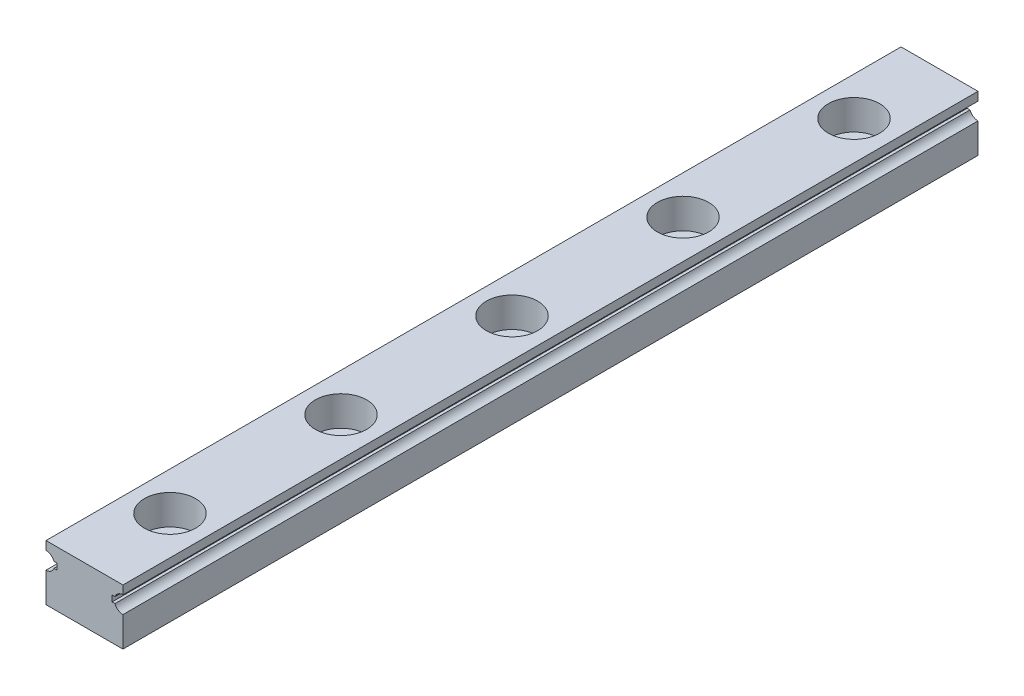
ISO-10303-21;
HEADER;
FILE_DESCRIPTION(('STEP AP214'),'2;1');
FILE_NAME('part.step','',(''),(''),'','','');
FILE_SCHEMA(('AUTOMOTIVE_DESIGN { 1 0 10303 214 1 1 1 1 }'));
ENDSEC;
DATA;
#1=APPLICATION_CONTEXT('core data for automotive mechanical design processes');
#2=APPLICATION_PROTOCOL_DEFINITION('international standard','automotive_design',2000,#1);
#3=PRODUCT_CONTEXT('',#1,'mechanical');
#4=PRODUCT('Part','Part','',(#3));
#5=PRODUCT_RELATED_PRODUCT_CATEGORY('part','',(#4));
#6=PRODUCT_DEFINITION_FORMATION('','',#4);
#7=PRODUCT_DEFINITION_CONTEXT('part definition',#1,'design');
#8=PRODUCT_DEFINITION('design','',#6,#7);
#9=PRODUCT_DEFINITION_SHAPE('','',#8);
#10=(LENGTH_UNIT() NAMED_UNIT(*) SI_UNIT(.MILLI.,.METRE.));
#11=(NAMED_UNIT(*) PLANE_ANGLE_UNIT() SI_UNIT($,.RADIAN.));
#12=(NAMED_UNIT(*) SI_UNIT($,.STERADIAN.) SOLID_ANGLE_UNIT());
#13=UNCERTAINTY_MEASURE_WITH_UNIT(LENGTH_MEASURE(1.E-05),#10,'distance_accuracy_value','');
#14=(GEOMETRIC_REPRESENTATION_CONTEXT(3) GLOBAL_UNCERTAINTY_ASSIGNED_CONTEXT((#13)) GLOBAL_UNIT_ASSIGNED_CONTEXT((#10,
#11,#12)) REPRESENTATION_CONTEXT('',''));
#15=CARTESIAN_POINT('',(0.,0.,0.));
#16=DIRECTION('',(0.,0.,1.));
#17=DIRECTION('',(1.,0.,0.));
#18=AXIS2_PLACEMENT_3D('',#15,#16,#17);
#19=CARTESIAN_POINT('',(4.5,2.25,100.));
#20=DIRECTION('',(-1.,0.,0.));
#21=DIRECTION('',(0.,-1.,0.));
#22=AXIS2_PLACEMENT_3D('',#19,#20,#21);
#23=PLANE('',#22);
#24=DIRECTION('',(0.,1.,0.));
#25=VECTOR('',#24,1.);
#26=CARTESIAN_POINT('',(4.5,2.25,0.));
#27=LINE('',#26,#25);
#28=CARTESIAN_POINT('',(4.5,2.25,0.));
#29=VERTEX_POINT('',#28);
#30=CARTESIAN_POINT('',(4.5,3.25,0.));
#31=VERTEX_POINT('',#30);
#32=EDGE_CURVE('E193',#29,#31,#27,.T.);
#33=ORIENTED_EDGE('',*,*,#32,.T.);
#34=DIRECTION('',(0.,0.,-1.));
#35=VECTOR('',#34,1.);
#36=CARTESIAN_POINT('',(4.5,3.25,100.));
#37=LINE('',#36,#35);
#38=CARTESIAN_POINT('',(4.5,3.25,100.));
#39=VERTEX_POINT('',#38);
#40=EDGE_CURVE('E11',#39,#31,#37,.T.);
#41=ORIENTED_EDGE('',*,*,#40,.F.);
#42=DIRECTION('',(0.,1.,0.));
#43=VECTOR('',#42,1.);
#44=CARTESIAN_POINT('',(4.5,2.25,100.));
#45=LINE('',#44,#43);
#46=CARTESIAN_POINT('',(4.5,2.25,100.));
#47=VERTEX_POINT('',#46);
#48=EDGE_CURVE('E228',#47,#39,#45,.T.);
#49=ORIENTED_EDGE('',*,*,#48,.F.);
#50=DIRECTION('',(0.,0.,-1.));
#51=VECTOR('',#50,1.);
#52=CARTESIAN_POINT('',(4.5,2.25,100.));
#53=LINE('',#52,#51);
#54=EDGE_CURVE('E189',#47,#29,#53,.T.);
#55=ORIENTED_EDGE('',*,*,#54,.T.);
#56=EDGE_LOOP('',(#33,#41,#49,#55));
#57=FACE_BOUND('',#56,.T.);
#58=ADVANCED_FACE('F45',(#57),#23,.F.);
#59=CARTESIAN_POINT('',(-4.5,3.25,100.));
#60=DIRECTION('',(0.,-1.,0.));
#61=DIRECTION('',(0.,0.,-1.));
#62=AXIS2_PLACEMENT_3D('',#59,#60,#61);
#63=PLANE('',#62);
#64=CARTESIAN_POINT('',(0.,3.25,90.));
#65=DIRECTION('',(0.,1.,0.));
#66=DIRECTION('',(0.,0.,1.));
#67=AXIS2_PLACEMENT_3D('',#64,#65,#66);
#68=CIRCLE('',#67,3.);
#69=CARTESIAN_POINT('',(0.,3.25,93.));
#70=VERTEX_POINT('',#69);
#71=EDGE_CURVE('E287',#70,#70,#68,.T.);
#72=ORIENTED_EDGE('',*,*,#71,.F.);
#73=EDGE_LOOP('',(#72));
#74=FACE_BOUND('',#73,.T.);
#75=CARTESIAN_POINT('',(0.,3.25,70.));
#76=DIRECTION('',(0.,1.,0.));
#77=DIRECTION('',(0.,0.,1.));
#78=AXIS2_PLACEMENT_3D('',#75,#76,#77);
#79=CIRCLE('',#78,3.);
#80=CARTESIAN_POINT('',(0.,3.25,73.));
#81=VERTEX_POINT('',#80);
#82=EDGE_CURVE('E320',#81,#81,#79,.T.);
#83=ORIENTED_EDGE('',*,*,#82,.F.);
#84=EDGE_LOOP('',(#83));
#85=FACE_BOUND('',#84,.T.);
#86=CARTESIAN_POINT('',(0.,3.25,50.));
#87=DIRECTION('',(0.,1.,0.));
#88=DIRECTION('',(0.,0.,1.));
#89=AXIS2_PLACEMENT_3D('',#86,#87,#88);
#90=CIRCLE('',#89,3.);
#91=CARTESIAN_POINT('',(0.,3.25,53.));
#92=VERTEX_POINT('',#91);
#93=EDGE_CURVE('E327',#92,#92,#90,.T.);
#94=ORIENTED_EDGE('',*,*,#93,.F.);
#95=EDGE_LOOP('',(#94));
#96=FACE_BOUND('',#95,.T.);
#97=CARTESIAN_POINT('',(0.,3.25,30.));
#98=DIRECTION('',(0.,1.,0.));
#99=DIRECTION('',(0.,0.,1.));
#100=AXIS2_PLACEMENT_3D('',#97,#98,#99);
#101=CIRCLE('',#100,3.);
#102=CARTESIAN_POINT('',(0.,3.25,33.));
#103=VERTEX_POINT('',#102);
#104=EDGE_CURVE('E335',#103,#103,#101,.T.);
#105=ORIENTED_EDGE('',*,*,#104,.F.);
#106=EDGE_LOOP('',(#105));
#107=FACE_BOUND('',#106,.T.);
#108=CARTESIAN_POINT('',(0.,3.25,10.));
#109=DIRECTION('',(0.,1.,0.));
#110=DIRECTION('',(0.,0.,1.));
#111=AXIS2_PLACEMENT_3D('',#108,#109,#110);
#112=CIRCLE('',#111,3.);
#113=CARTESIAN_POINT('',(0.,3.25,13.));
#114=VERTEX_POINT('',#113);
#115=EDGE_CURVE('E282',#114,#114,#112,.T.);
#116=ORIENTED_EDGE('',*,*,#115,.F.);
#117=EDGE_LOOP('',(#116));
#118=FACE_BOUND('',#117,.T.);
#119=DIRECTION('',(-1.,0.,0.));
#120=VECTOR('',#119,1.);
#121=CARTESIAN_POINT('',(-4.5,3.25,0.));
#122=LINE('',#121,#120);
#123=CARTESIAN_POINT('',(-4.5,3.25,0.));
#124=VERTEX_POINT('',#123);
#125=EDGE_CURVE('E196',#31,#124,#122,.T.);
#126=ORIENTED_EDGE('',*,*,#125,.T.);
#127=DIRECTION('',(0.,0.,-1.));
#128=VECTOR('',#127,1.);
#129=CARTESIAN_POINT('',(-4.5,3.25,100.));
#130=LINE('',#129,#128);
#131=CARTESIAN_POINT('',(-4.5,3.25,100.));
#132=VERTEX_POINT('',#131);
#133=EDGE_CURVE('E55',#132,#124,#130,.T.);
#134=ORIENTED_EDGE('',*,*,#133,.F.);
#135=DIRECTION('',(-1.,0.,0.));
#136=VECTOR('',#135,1.);
#137=CARTESIAN_POINT('',(-4.5,3.25,100.));
#138=LINE('',#137,#136);
#139=EDGE_CURVE('E131',#39,#132,#138,.T.);
#140=ORIENTED_EDGE('',*,*,#139,.F.);
#141=ORIENTED_EDGE('',*,*,#40,.T.);
#142=EDGE_LOOP('',(#126,#134,#140,#141));
#143=FACE_BOUND('',#142,.T.);
#144=ADVANCED_FACE('F405',(#74,#85,#96,#107,#118,#143),#63,.F.);
#145=CARTESIAN_POINT('',(-4.5,2.25,100.));
#146=DIRECTION('',(1.,0.,0.));
#147=DIRECTION('',(0.,0.,-1.));
#148=AXIS2_PLACEMENT_3D('',#145,#146,#147);
#149=PLANE('',#148);
#150=DIRECTION('',(0.,-1.,0.));
#151=VECTOR('',#150,1.);
#152=CARTESIAN_POINT('',(-4.5,2.25,0.));
#153=LINE('',#152,#151);
#154=CARTESIAN_POINT('',(-4.5,2.25,0.));
#155=VERTEX_POINT('',#154);
#156=EDGE_CURVE('E200',#124,#155,#153,.T.);
#157=ORIENTED_EDGE('',*,*,#156,.T.);
#158=DIRECTION('',(0.,0.,-1.));
#159=VECTOR('',#158,1.);
#160=CARTESIAN_POINT('',(-4.5,2.25,100.));
#161=LINE('',#160,#159);
#162=CARTESIAN_POINT('',(-4.5,2.25,100.));
#163=VERTEX_POINT('',#162);
#164=EDGE_CURVE('E271',#163,#155,#161,.T.);
#165=ORIENTED_EDGE('',*,*,#164,.F.);
#166=DIRECTION('',(0.,-1.,0.));
#167=VECTOR('',#166,1.);
#168=CARTESIAN_POINT('',(-4.5,2.25,100.));
#169=LINE('',#168,#167);
#170=EDGE_CURVE('E357',#132,#163,#169,.T.);
#171=ORIENTED_EDGE('',*,*,#170,.F.);
#172=ORIENTED_EDGE('',*,*,#133,.T.);
#173=EDGE_LOOP('',(#157,#165,#171,#172));
#174=FACE_BOUND('',#173,.T.);
#175=ADVANCED_FACE('F410',(#174),#149,.F.);
#176=CARTESIAN_POINT('',(-4.5,1.25,100.));
#177=DIRECTION('',(0.,0.,-1.));
#178=DIRECTION('',(-1.,0.,0.));
#179=AXIS2_PLACEMENT_3D('',#176,#177,#178);
#180=CYLINDRICAL_SURFACE('',#179,1.);
#181=CARTESIAN_POINT('',(-4.5,1.25,0.));
#182=DIRECTION('',(0.,0.,-1.));
#183=DIRECTION('',(1.,0.,0.));
#184=AXIS2_PLACEMENT_3D('',#181,#182,#183);
#185=CIRCLE('',#184,1.);
#186=CARTESIAN_POINT('',(-3.56399113733362,1.60197643246385,0.));
#187=VERTEX_POINT('',#186);
#188=EDGE_CURVE('E202',#155,#187,#185,.T.);
#189=ORIENTED_EDGE('',*,*,#188,.T.);
#190=DIRECTION('',(0.,0.,-1.));
#191=VECTOR('',#190,1.);
#192=CARTESIAN_POINT('',(-3.56399113733362,1.60197643246385,100.));
#193=LINE('',#192,#191);
#194=CARTESIAN_POINT('',(-3.56399113733362,1.60197643246385,100.));
#195=VERTEX_POINT('',#194);
#196=EDGE_CURVE('E267',#195,#187,#193,.T.);
#197=ORIENTED_EDGE('',*,*,#196,.F.);
#198=CARTESIAN_POINT('',(-4.5,1.25,100.));
#199=DIRECTION('',(0.,0.,-1.));
#200=DIRECTION('',(1.,0.,0.));
#201=AXIS2_PLACEMENT_3D('',#198,#199,#200);
#202=CIRCLE('',#201,1.);
#203=EDGE_CURVE('E359',#163,#195,#202,.T.);
#204=ORIENTED_EDGE('',*,*,#203,.F.);
#205=ORIENTED_EDGE('',*,*,#164,.T.);
#206=EDGE_LOOP('',(#189,#197,#204,#205));
#207=FACE_BOUND('',#206,.T.);
#208=ADVANCED_FACE('F415',(#207),#180,.F.);
#209=CARTESIAN_POINT('',(-3.56399113733362,1.60197643246385,100.));
#210=DIRECTION('',(0.,1.,0.));
#211=DIRECTION('',(0.,0.,1.));
#212=AXIS2_PLACEMENT_3D('',#209,#210,#211);
#213=PLANE('',#212);
#214=DIRECTION('',(1.,0.,0.));
#215=VECTOR('',#214,1.);
#216=CARTESIAN_POINT('',(-3.56399113733362,1.60197643246385,0.));
#217=LINE('',#216,#215);
#218=CARTESIAN_POINT('',(-3.23507302495561,1.60197643246385,0.));
#219=VERTEX_POINT('',#218);
#220=EDGE_CURVE('E204',#187,#219,#217,.T.);
#221=ORIENTED_EDGE('',*,*,#220,.T.);
#222=DIRECTION('',(0.,0.,-1.));
#223=VECTOR('',#222,1.);
#224=CARTESIAN_POINT('',(-3.23507302495561,1.60197643246385,100.));
#225=LINE('',#224,#223);
#226=CARTESIAN_POINT('',(-3.23507302495561,1.60197643246385,100.));
#227=VERTEX_POINT('',#226);
#228=EDGE_CURVE('E263',#227,#219,#225,.T.);
#229=ORIENTED_EDGE('',*,*,#228,.F.);
#230=DIRECTION('',(1.,0.,0.));
#231=VECTOR('',#230,1.);
#232=CARTESIAN_POINT('',(-3.56399113733362,1.60197643246385,100.));
#233=LINE('',#232,#231);
#234=EDGE_CURVE('E361',#195,#227,#233,.T.);
#235=ORIENTED_EDGE('',*,*,#234,.F.);
#236=ORIENTED_EDGE('',*,*,#196,.T.);
#237=EDGE_LOOP('',(#221,#229,#235,#236));
#238=FACE_BOUND('',#237,.T.);
#239=ADVANCED_FACE('F423',(#238),#213,.F.);
#240=CARTESIAN_POINT('',(-3.23507302495561,0.898023567536146,100.));
#241=DIRECTION('',(1.,0.,0.));
#242=DIRECTION('',(0.,0.,-1.));
#243=AXIS2_PLACEMENT_3D('',#240,#241,#242);
#244=PLANE('',#243);
#245=DIRECTION('',(0.,-1.,0.));
#246=VECTOR('',#245,1.);
#247=CARTESIAN_POINT('',(-3.23507302495561,0.898023567536146,0.));
#248=LINE('',#247,#246);
#249=CARTESIAN_POINT('',(-3.23507302495561,0.898023567536146,0.));
#250=VERTEX_POINT('',#249);
#251=EDGE_CURVE('E206',#219,#250,#248,.T.);
#252=ORIENTED_EDGE('',*,*,#251,.T.);
#253=DIRECTION('',(0.,0.,-1.));
#254=VECTOR('',#253,1.);
#255=CARTESIAN_POINT('',(-3.23507302495561,0.898023567536146,100.));
#256=LINE('',#255,#254);
#257=CARTESIAN_POINT('',(-3.23507302495561,0.898023567536146,100.));
#258=VERTEX_POINT('',#257);
#259=EDGE_CURVE('E259',#258,#250,#256,.T.);
#260=ORIENTED_EDGE('',*,*,#259,.F.);
#261=DIRECTION('',(0.,-1.,0.));
#262=VECTOR('',#261,1.);
#263=CARTESIAN_POINT('',(-3.23507302495561,0.898023567536146,100.));
#264=LINE('',#263,#262);
#265=EDGE_CURVE('E363',#227,#258,#264,.T.);
#266=ORIENTED_EDGE('',*,*,#265,.F.);
#267=ORIENTED_EDGE('',*,*,#228,.T.);
#268=EDGE_LOOP('',(#252,#260,#266,#267));
#269=FACE_BOUND('',#268,.T.);
#270=ADVANCED_FACE('F427',(#269),#244,.F.);
#271=CARTESIAN_POINT('',(-3.56399113733362,0.898023567536146,100.));
#272=DIRECTION('',(0.,-1.,0.));
#273=DIRECTION('',(0.,0.,-1.));
#274=AXIS2_PLACEMENT_3D('',#271,#272,#273);
#275=PLANE('',#274);
#276=DIRECTION('',(-1.,0.,0.));
#277=VECTOR('',#276,1.);
#278=CARTESIAN_POINT('',(-3.56399113733362,0.898023567536146,0.));
#279=LINE('',#278,#277);
#280=CARTESIAN_POINT('',(-3.56399113733362,0.898023567536146,0.));
#281=VERTEX_POINT('',#280);
#282=EDGE_CURVE('E208',#250,#281,#279,.T.);
#283=ORIENTED_EDGE('',*,*,#282,.T.);
#284=DIRECTION('',(0.,0.,-1.));
#285=VECTOR('',#284,1.);
#286=CARTESIAN_POINT('',(-3.56399113733362,0.898023567536146,100.));
#287=LINE('',#286,#285);
#288=CARTESIAN_POINT('',(-3.56399113733362,0.898023567536146,100.));
#289=VERTEX_POINT('',#288);
#290=EDGE_CURVE('E255',#289,#281,#287,.T.);
#291=ORIENTED_EDGE('',*,*,#290,.F.);
#292=DIRECTION('',(-1.,0.,0.));
#293=VECTOR('',#292,1.);
#294=CARTESIAN_POINT('',(-3.56399113733362,0.898023567536146,100.));
#295=LINE('',#294,#293);
#296=EDGE_CURVE('E365',#258,#289,#295,.T.);
#297=ORIENTED_EDGE('',*,*,#296,.F.);
#298=ORIENTED_EDGE('',*,*,#259,.T.);
#299=EDGE_LOOP('',(#283,#291,#297,#298));
#300=FACE_BOUND('',#299,.T.);
#301=ADVANCED_FACE('F431',(#300),#275,.F.);
#302=CARTESIAN_POINT('',(-4.5,1.25,100.));
#303=DIRECTION('',(0.,0.,-1.));
#304=DIRECTION('',(-1.,0.,0.));
#305=AXIS2_PLACEMENT_3D('',#302,#303,#304);
#306=CYLINDRICAL_SURFACE('',#305,1.);
#307=CARTESIAN_POINT('',(-4.5,1.25,0.));
#308=DIRECTION('',(0.,0.,-1.));
#309=DIRECTION('',(1.,0.,0.));
#310=AXIS2_PLACEMENT_3D('',#307,#308,#309);
#311=CIRCLE('',#310,1.);
#312=CARTESIAN_POINT('',(-4.5,0.25,0.));
#313=VERTEX_POINT('',#312);
#314=EDGE_CURVE('E210',#281,#313,#311,.T.);
#315=ORIENTED_EDGE('',*,*,#314,.T.);
#316=DIRECTION('',(0.,0.,-1.));
#317=VECTOR('',#316,1.);
#318=CARTESIAN_POINT('',(-4.5,0.25,100.));
#319=LINE('',#318,#317);
#320=CARTESIAN_POINT('',(-4.5,0.25,100.));
#321=VERTEX_POINT('',#320);
#322=EDGE_CURVE('E251',#321,#313,#319,.T.);
#323=ORIENTED_EDGE('',*,*,#322,.F.);
#324=CARTESIAN_POINT('',(-4.5,1.25,100.));
#325=DIRECTION('',(0.,0.,-1.));
#326=DIRECTION('',(1.,0.,0.));
#327=AXIS2_PLACEMENT_3D('',#324,#325,#326);
#328=CIRCLE('',#327,1.);
#329=EDGE_CURVE('E367',#289,#321,#328,.T.);
#330=ORIENTED_EDGE('',*,*,#329,.F.);
#331=ORIENTED_EDGE('',*,*,#290,.T.);
#332=EDGE_LOOP('',(#315,#323,#330,#331));
#333=FACE_BOUND('',#332,.T.);
#334=ADVANCED_FACE('F435',(#333),#306,.F.);
#335=CARTESIAN_POINT('',(-4.5,-3.25,100.));
#336=DIRECTION('',(1.,0.,0.));
#337=DIRECTION('',(0.,0.,-1.));
#338=AXIS2_PLACEMENT_3D('',#335,#336,#337);
#339=PLANE('',#338);
#340=DIRECTION('',(0.,-1.,0.));
#341=VECTOR('',#340,1.);
#342=CARTESIAN_POINT('',(-4.5,-3.25,0.));
#343=LINE('',#342,#341);
#344=CARTESIAN_POINT('',(-4.5,-3.25,0.));
#345=VERTEX_POINT('',#344);
#346=EDGE_CURVE('E212',#313,#345,#343,.T.);
#347=ORIENTED_EDGE('',*,*,#346,.T.);
#348=DIRECTION('',(0.,0.,-1.));
#349=VECTOR('',#348,1.);
#350=CARTESIAN_POINT('',(-4.5,-3.25,100.));
#351=LINE('',#350,#349);
#352=CARTESIAN_POINT('',(-4.5,-3.25,100.));
#353=VERTEX_POINT('',#352);
#354=EDGE_CURVE('E247',#353,#345,#351,.T.);
#355=ORIENTED_EDGE('',*,*,#354,.F.);
#356=DIRECTION('',(0.,-1.,0.));
#357=VECTOR('',#356,1.);
#358=CARTESIAN_POINT('',(-4.5,-3.25,100.));
#359=LINE('',#358,#357);
#360=EDGE_CURVE('E369',#321,#353,#359,.T.);
#361=ORIENTED_EDGE('',*,*,#360,.F.);
#362=ORIENTED_EDGE('',*,*,#322,.T.);
#363=EDGE_LOOP('',(#347,#355,#361,#362));
#364=FACE_BOUND('',#363,.T.);
#365=ADVANCED_FACE('F439',(#364),#339,.F.);
#366=CARTESIAN_POINT('',(-4.5,-3.25,100.));
#367=DIRECTION('',(0.,1.,0.));
#368=DIRECTION('',(0.,0.,1.));
#369=AXIS2_PLACEMENT_3D('',#366,#367,#368);
#370=PLANE('',#369);
#371=CARTESIAN_POINT('',(0.,-3.25,90.));
#372=DIRECTION('',(0.,1.,0.));
#373=DIRECTION('',(0.,0.,1.));
#374=AXIS2_PLACEMENT_3D('',#371,#372,#373);
#375=CIRCLE('',#374,1.75);
#376=CARTESIAN_POINT('',(0.,-3.25,91.75));
#377=VERTEX_POINT('',#376);
#378=EDGE_CURVE('E312',#377,#377,#375,.T.);
#379=ORIENTED_EDGE('',*,*,#378,.T.);
#380=EDGE_LOOP('',(#379));
#381=FACE_BOUND('',#380,.T.);
#382=CARTESIAN_POINT('',(0.,-3.25,70.));
#383=DIRECTION('',(0.,1.,0.));
#384=DIRECTION('',(0.,0.,1.));
#385=AXIS2_PLACEMENT_3D('',#382,#383,#384);
#386=CIRCLE('',#385,1.75);
#387=CARTESIAN_POINT('',(0.,-3.25,71.75));
#388=VERTEX_POINT('',#387);
#389=EDGE_CURVE('E296',#388,#388,#386,.T.);
#390=ORIENTED_EDGE('',*,*,#389,.T.);
#391=EDGE_LOOP('',(#390));
#392=FACE_BOUND('',#391,.T.);
#393=CARTESIAN_POINT('',(0.,-3.25,50.));
#394=DIRECTION('',(0.,1.,0.));
#395=DIRECTION('',(0.,0.,1.));
#396=AXIS2_PLACEMENT_3D('',#393,#394,#395);
#397=CIRCLE('',#396,1.75);
#398=CARTESIAN_POINT('',(0.,-3.25,51.75));
#399=VERTEX_POINT('',#398);
#400=EDGE_CURVE('E292',#399,#399,#397,.T.);
#401=ORIENTED_EDGE('',*,*,#400,.T.);
#402=EDGE_LOOP('',(#401));
#403=FACE_BOUND('',#402,.T.);
#404=CARTESIAN_POINT('',(0.,-3.25,30.));
#405=DIRECTION('',(0.,1.,0.));
#406=DIRECTION('',(0.,0.,1.));
#407=AXIS2_PLACEMENT_3D('',#404,#405,#406);
#408=CIRCLE('',#407,1.75);
#409=CARTESIAN_POINT('',(0.,-3.25,31.75));
#410=VERTEX_POINT('',#409);
#411=EDGE_CURVE('E288',#410,#410,#408,.T.);
#412=ORIENTED_EDGE('',*,*,#411,.T.);
#413=EDGE_LOOP('',(#412));
#414=FACE_BOUND('',#413,.T.);
#415=CARTESIAN_POINT('',(0.,-3.25,10.));
#416=DIRECTION('',(0.,1.,0.));
#417=DIRECTION('',(0.,0.,1.));
#418=AXIS2_PLACEMENT_3D('',#415,#416,#417);
#419=CIRCLE('',#418,1.75);
#420=CARTESIAN_POINT('',(0.,-3.25,11.75));
#421=VERTEX_POINT('',#420);
#422=EDGE_CURVE('E283',#421,#421,#419,.T.);
#423=ORIENTED_EDGE('',*,*,#422,.T.);
#424=EDGE_LOOP('',(#423));
#425=FACE_BOUND('',#424,.T.);
#426=DIRECTION('',(1.,0.,0.));
#427=VECTOR('',#426,1.);
#428=CARTESIAN_POINT('',(-4.5,-3.25,0.));
#429=LINE('',#428,#427);
#430=CARTESIAN_POINT('',(4.5,-3.25,0.));
#431=VERTEX_POINT('',#430);
#432=EDGE_CURVE('E215',#345,#431,#429,.T.);
#433=ORIENTED_EDGE('',*,*,#432,.T.);
#434=DIRECTION('',(0.,0.,-1.));
#435=VECTOR('',#434,1.);
#436=CARTESIAN_POINT('',(4.5,-3.25,100.));
#437=LINE('',#436,#435);
#438=CARTESIAN_POINT('',(4.5,-3.25,100.));
#439=VERTEX_POINT('',#438);
#440=EDGE_CURVE('E243',#439,#431,#437,.T.);
#441=ORIENTED_EDGE('',*,*,#440,.F.);
#442=DIRECTION('',(1.,0.,0.));
#443=VECTOR('',#442,1.);
#444=CARTESIAN_POINT('',(-4.5,-3.25,100.));
#445=LINE('',#444,#443);
#446=EDGE_CURVE('E371',#353,#439,#445,.T.);
#447=ORIENTED_EDGE('',*,*,#446,.F.);
#448=ORIENTED_EDGE('',*,*,#354,.T.);
#449=EDGE_LOOP('',(#433,#441,#447,#448));
#450=FACE_BOUND('',#449,.T.);
#451=ADVANCED_FACE('F443',(#381,#392,#403,#414,#425,#450),#370,.F.);
#452=CARTESIAN_POINT('',(4.5,-3.25,100.));
#453=DIRECTION('',(-1.,0.,0.));
#454=DIRECTION('',(0.,-1.,0.));
#455=AXIS2_PLACEMENT_3D('',#452,#453,#454);
#456=PLANE('',#455);
#457=DIRECTION('',(0.,1.,0.));
#458=VECTOR('',#457,1.);
#459=CARTESIAN_POINT('',(4.5,-3.25,0.));
#460=LINE('',#459,#458);
#461=CARTESIAN_POINT('',(4.5,0.25,0.));
#462=VERTEX_POINT('',#461);
#463=EDGE_CURVE('E218',#431,#462,#460,.T.);
#464=ORIENTED_EDGE('',*,*,#463,.T.);
#465=DIRECTION('',(0.,0.,-1.));
#466=VECTOR('',#465,1.);
#467=CARTESIAN_POINT('',(4.5,0.25,100.));
#468=LINE('',#467,#466);
#469=CARTESIAN_POINT('',(4.5,0.25,100.));
#470=VERTEX_POINT('',#469);
#471=EDGE_CURVE('E239',#470,#462,#468,.T.);
#472=ORIENTED_EDGE('',*,*,#471,.F.);
#473=DIRECTION('',(0.,1.,0.));
#474=VECTOR('',#473,1.);
#475=CARTESIAN_POINT('',(4.5,-3.25,100.));
#476=LINE('',#475,#474);
#477=EDGE_CURVE('E373',#439,#470,#476,.T.);
#478=ORIENTED_EDGE('',*,*,#477,.F.);
#479=ORIENTED_EDGE('',*,*,#440,.T.);
#480=EDGE_LOOP('',(#464,#472,#478,#479));
#481=FACE_BOUND('',#480,.T.);
#482=ADVANCED_FACE('F447',(#481),#456,.F.);
#483=CARTESIAN_POINT('',(4.5,1.25,100.));
#484=DIRECTION('',(0.,0.,-1.));
#485=DIRECTION('',(-1.,0.,0.));
#486=AXIS2_PLACEMENT_3D('',#483,#484,#485);
#487=CYLINDRICAL_SURFACE('',#486,1.);
#488=CARTESIAN_POINT('',(4.5,1.25,0.));
#489=DIRECTION('',(0.,0.,-1.));
#490=DIRECTION('',(-1.,0.,0.));
#491=AXIS2_PLACEMENT_3D('',#488,#489,#490);
#492=CIRCLE('',#491,1.);
#493=CARTESIAN_POINT('',(3.56399113733362,0.898023567536145,0.));
#494=VERTEX_POINT('',#493);
#495=EDGE_CURVE('E221',#462,#494,#492,.T.);
#496=ORIENTED_EDGE('',*,*,#495,.T.);
#497=DIRECTION('',(0.,0.,-1.));
#498=VECTOR('',#497,1.);
#499=CARTESIAN_POINT('',(3.56399113733362,0.898023567536145,100.));
#500=LINE('',#499,#498);
#501=CARTESIAN_POINT('',(3.56399113733362,0.898023567536145,100.));
#502=VERTEX_POINT('',#501);
#503=EDGE_CURVE('E235',#502,#494,#500,.T.);
#504=ORIENTED_EDGE('',*,*,#503,.F.);
#505=CARTESIAN_POINT('',(4.5,1.25,100.));
#506=DIRECTION('',(0.,0.,-1.));
#507=DIRECTION('',(-1.,0.,0.));
#508=AXIS2_PLACEMENT_3D('',#505,#506,#507);
#509=CIRCLE('',#508,1.);
#510=EDGE_CURVE('E375',#470,#502,#509,.T.);
#511=ORIENTED_EDGE('',*,*,#510,.F.);
#512=ORIENTED_EDGE('',*,*,#471,.T.);
#513=EDGE_LOOP('',(#496,#504,#511,#512));
#514=FACE_BOUND('',#513,.T.);
#515=ADVANCED_FACE('F381',(#514),#487,.F.);
#516=CARTESIAN_POINT('',(3.56399113733362,0.898023567536146,100.));
#517=DIRECTION('',(0.,-1.,0.));
#518=DIRECTION('',(0.,0.,-1.));
#519=AXIS2_PLACEMENT_3D('',#516,#517,#518);
#520=PLANE('',#519);
#521=DIRECTION('',(-1.,0.,0.));
#522=VECTOR('',#521,1.);
#523=CARTESIAN_POINT('',(3.56399113733362,0.898023567536146,0.));
#524=LINE('',#523,#522);
#525=CARTESIAN_POINT('',(3.23507302495561,0.898023567536146,0.));
#526=VERTEX_POINT('',#525);
#527=EDGE_CURVE('E223',#494,#526,#524,.T.);
#528=ORIENTED_EDGE('',*,*,#527,.T.);
#529=DIRECTION('',(0.,0.,-1.));
#530=VECTOR('',#529,1.);
#531=CARTESIAN_POINT('',(3.23507302495561,0.898023567536146,100.));
#532=LINE('',#531,#530);
#533=CARTESIAN_POINT('',(3.23507302495561,0.898023567536146,100.));
#534=VERTEX_POINT('',#533);
#535=EDGE_CURVE('E184',#534,#526,#532,.T.);
#536=ORIENTED_EDGE('',*,*,#535,.F.);
#537=DIRECTION('',(-1.,0.,0.));
#538=VECTOR('',#537,1.);
#539=CARTESIAN_POINT('',(3.56399113733362,0.898023567536146,100.));
#540=LINE('',#539,#538);
#541=EDGE_CURVE('E174',#502,#534,#540,.T.);
#542=ORIENTED_EDGE('',*,*,#541,.F.);
#543=ORIENTED_EDGE('',*,*,#503,.T.);
#544=EDGE_LOOP('',(#528,#536,#542,#543));
#545=FACE_BOUND('',#544,.T.);
#546=ADVANCED_FACE('F385',(#545),#520,.F.);
#547=CARTESIAN_POINT('',(3.23507302495561,0.898023567536146,100.));
#548=DIRECTION('',(-1.,0.,0.));
#549=DIRECTION('',(0.,0.,1.));
#550=AXIS2_PLACEMENT_3D('',#547,#548,#549);
#551=PLANE('',#550);
#552=DIRECTION('',(0.,1.,0.));
#553=VECTOR('',#552,1.);
#554=CARTESIAN_POINT('',(3.23507302495561,0.898023567536146,0.));
#555=LINE('',#554,#553);
#556=CARTESIAN_POINT('',(3.23507302495561,1.60197643246385,0.));
#557=VERTEX_POINT('',#556);
#558=EDGE_CURVE('E182',#526,#557,#555,.T.);
#559=ORIENTED_EDGE('',*,*,#558,.T.);
#560=DIRECTION('',(0.,0.,-1.));
#561=VECTOR('',#560,1.);
#562=CARTESIAN_POINT('',(3.23507302495561,1.60197643246385,100.));
#563=LINE('',#562,#561);
#564=CARTESIAN_POINT('',(3.23507302495561,1.60197643246385,100.));
#565=VERTEX_POINT('',#564);
#566=EDGE_CURVE('E179',#565,#557,#563,.T.);
#567=ORIENTED_EDGE('',*,*,#566,.F.);
#568=DIRECTION('',(0.,1.,0.));
#569=VECTOR('',#568,1.);
#570=CARTESIAN_POINT('',(3.23507302495561,0.898023567536146,100.));
#571=LINE('',#570,#569);
#572=EDGE_CURVE('E168',#534,#565,#571,.T.);
#573=ORIENTED_EDGE('',*,*,#572,.F.);
#574=ORIENTED_EDGE('',*,*,#535,.T.);
#575=EDGE_LOOP('',(#559,#567,#573,#574));
#576=FACE_BOUND('',#575,.T.);
#577=ADVANCED_FACE('F180',(#576),#551,.F.);
#578=CARTESIAN_POINT('',(3.56399113733362,1.60197643246385,100.));
#579=DIRECTION('',(0.,1.,0.));
#580=DIRECTION('',(0.,0.,1.));
#581=AXIS2_PLACEMENT_3D('',#578,#579,#580);
#582=PLANE('',#581);
#583=DIRECTION('',(1.,0.,0.));
#584=VECTOR('',#583,1.);
#585=CARTESIAN_POINT('',(3.56399113733362,1.60197643246385,0.));
#586=LINE('',#585,#584);
#587=CARTESIAN_POINT('',(3.56399113733362,1.60197643246385,0.));
#588=VERTEX_POINT('',#587);
#589=EDGE_CURVE('E117',#557,#588,#586,.T.);
#590=ORIENTED_EDGE('',*,*,#589,.T.);
#591=DIRECTION('',(0.,0.,-1.));
#592=VECTOR('',#591,1.);
#593=CARTESIAN_POINT('',(3.56399113733362,1.60197643246385,100.));
#594=LINE('',#593,#592);
#595=CARTESIAN_POINT('',(3.56399113733362,1.60197643246385,100.));
#596=VERTEX_POINT('',#595);
#597=EDGE_CURVE('E185',#596,#588,#594,.T.);
#598=ORIENTED_EDGE('',*,*,#597,.F.);
#599=DIRECTION('',(1.,0.,0.));
#600=VECTOR('',#599,1.);
#601=CARTESIAN_POINT('',(3.56399113733362,1.60197643246385,100.));
#602=LINE('',#601,#600);
#603=EDGE_CURVE('E172',#565,#596,#602,.T.);
#604=ORIENTED_EDGE('',*,*,#603,.F.);
#605=ORIENTED_EDGE('',*,*,#566,.T.);
#606=EDGE_LOOP('',(#590,#598,#604,#605));
#607=FACE_BOUND('',#606,.T.);
#608=ADVANCED_FACE('F187',(#607),#582,.F.);
#609=CARTESIAN_POINT('',(4.5,1.25,100.));
#610=DIRECTION('',(0.,0.,-1.));
#611=DIRECTION('',(-1.,0.,0.));
#612=AXIS2_PLACEMENT_3D('',#609,#610,#611);
#613=CYLINDRICAL_SURFACE('',#612,1.);
#614=CARTESIAN_POINT('',(4.5,1.25,0.));
#615=DIRECTION('',(0.,0.,-1.));
#616=DIRECTION('',(-1.,0.,0.));
#617=AXIS2_PLACEMENT_3D('',#614,#615,#616);
#618=CIRCLE('',#617,1.);
#619=EDGE_CURVE('E123',#588,#29,#618,.T.);
#620=ORIENTED_EDGE('',*,*,#619,.T.);
#621=ORIENTED_EDGE('',*,*,#54,.F.);
#622=CARTESIAN_POINT('',(4.5,1.25,100.));
#623=DIRECTION('',(0.,0.,-1.));
#624=DIRECTION('',(-1.,0.,0.));
#625=AXIS2_PLACEMENT_3D('',#622,#623,#624);
#626=CIRCLE('',#625,1.);
#627=EDGE_CURVE('E64',#596,#47,#626,.T.);
#628=ORIENTED_EDGE('',*,*,#627,.F.);
#629=ORIENTED_EDGE('',*,*,#597,.T.);
#630=EDGE_LOOP('',(#620,#621,#628,#629));
#631=FACE_BOUND('',#630,.T.);
#632=ADVANCED_FACE('F393',(#631),#613,.F.);
#633=CARTESIAN_POINT('',(-4.5,1.25,100.));
#634=DIRECTION('',(0.,0.,1.));
#635=DIRECTION('',(1.,0.,0.));
#636=AXIS2_PLACEMENT_3D('',#633,#634,#635);
#637=PLANE('',#636);
#638=ORIENTED_EDGE('',*,*,#48,.T.);
#639=ORIENTED_EDGE('',*,*,#139,.T.);
#640=ORIENTED_EDGE('',*,*,#170,.T.);
#641=ORIENTED_EDGE('',*,*,#203,.T.);
#642=ORIENTED_EDGE('',*,*,#234,.T.);
#643=ORIENTED_EDGE('',*,*,#265,.T.);
#644=ORIENTED_EDGE('',*,*,#296,.T.);
#645=ORIENTED_EDGE('',*,*,#329,.T.);
#646=ORIENTED_EDGE('',*,*,#360,.T.);
#647=ORIENTED_EDGE('',*,*,#446,.T.);
#648=ORIENTED_EDGE('',*,*,#477,.T.);
#649=ORIENTED_EDGE('',*,*,#510,.T.);
#650=ORIENTED_EDGE('',*,*,#541,.T.);
#651=ORIENTED_EDGE('',*,*,#572,.T.);
#652=ORIENTED_EDGE('',*,*,#603,.T.);
#653=ORIENTED_EDGE('',*,*,#627,.T.);
#654=EDGE_LOOP('',(#638,#639,#640,#641,#642,#643,#644,#645,#646,#647,#648,#649,#650,#651,#652,#653));
#655=FACE_BOUND('',#654,.T.);
#656=ADVANCED_FACE('F170',(#655),#637,.T.);
#657=CARTESIAN_POINT('',(-4.5,1.25,0.));
#658=DIRECTION('',(0.,0.,1.));
#659=DIRECTION('',(1.,0.,0.));
#660=AXIS2_PLACEMENT_3D('',#657,#658,#659);
#661=PLANE('',#660);
#662=ORIENTED_EDGE('',*,*,#32,.F.);
#663=ORIENTED_EDGE('',*,*,#619,.F.);
#664=ORIENTED_EDGE('',*,*,#589,.F.);
#665=ORIENTED_EDGE('',*,*,#558,.F.);
#666=ORIENTED_EDGE('',*,*,#527,.F.);
#667=ORIENTED_EDGE('',*,*,#495,.F.);
#668=ORIENTED_EDGE('',*,*,#463,.F.);
#669=ORIENTED_EDGE('',*,*,#432,.F.);
#670=ORIENTED_EDGE('',*,*,#346,.F.);
#671=ORIENTED_EDGE('',*,*,#314,.F.);
#672=ORIENTED_EDGE('',*,*,#282,.F.);
#673=ORIENTED_EDGE('',*,*,#251,.F.);
#674=ORIENTED_EDGE('',*,*,#220,.F.);
#675=ORIENTED_EDGE('',*,*,#188,.F.);
#676=ORIENTED_EDGE('',*,*,#156,.F.);
#677=ORIENTED_EDGE('',*,*,#125,.F.);
#678=EDGE_LOOP('',(#662,#663,#664,#665,#666,#667,#668,#669,#670,#671,#672,#673,#674,#675,#676,#677));
#679=FACE_BOUND('',#678,.T.);
#680=ADVANCED_FACE('F388',(#679),#661,.F.);
#681=CARTESIAN_POINT('',(0.,-0.25,10.));
#682=DIRECTION('',(0.,1.,0.));
#683=DIRECTION('',(0.,0.,1.));
#684=AXIS2_PLACEMENT_3D('',#681,#682,#683);
#685=CYLINDRICAL_SURFACE('',#684,3.);
#686=CARTESIAN_POINT('',(0.,-0.25,10.));
#687=DIRECTION('',(0.,1.,0.));
#688=DIRECTION('',(0.,0.,1.));
#689=AXIS2_PLACEMENT_3D('',#686,#687,#688);
#690=CIRCLE('',#689,3.);
#691=CARTESIAN_POINT('',(0.,-0.25,13.));
#692=VERTEX_POINT('',#691);
#693=EDGE_CURVE('E197',#692,#692,#690,.T.);
#694=ORIENTED_EDGE('',*,*,#693,.F.);
#695=EDGE_LOOP('',(#694));
#696=FACE_BOUND('',#695,.T.);
#697=ORIENTED_EDGE('',*,*,#115,.T.);
#698=EDGE_LOOP('',(#697));
#699=FACE_BOUND('',#698,.T.);
#700=ADVANCED_FACE('F486',(#696,#699),#685,.F.);
#701=CARTESIAN_POINT('',(0.,-0.25,10.));
#702=DIRECTION('',(0.,1.,0.));
#703=DIRECTION('',(0.,0.,1.));
#704=AXIS2_PLACEMENT_3D('',#701,#702,#703);
#705=PLANE('',#704);
#706=CARTESIAN_POINT('',(0.,-0.25,10.));
#707=DIRECTION('',(0.,1.,0.));
#708=DIRECTION('',(0.,0.,1.));
#709=AXIS2_PLACEMENT_3D('',#706,#707,#708);
#710=CIRCLE('',#709,1.75);
#711=CARTESIAN_POINT('',(0.,-0.25,11.75));
#712=VERTEX_POINT('',#711);
#713=EDGE_CURVE('E278',#712,#712,#710,.T.);
#714=ORIENTED_EDGE('',*,*,#713,.F.);
#715=EDGE_LOOP('',(#714));
#716=FACE_BOUND('',#715,.T.);
#717=ORIENTED_EDGE('',*,*,#693,.T.);
#718=EDGE_LOOP('',(#717));
#719=FACE_BOUND('',#718,.T.);
#720=ADVANCED_FACE('F494',(#716,#719),#705,.T.);
#721=CARTESIAN_POINT('',(0.,-3.25,10.));
#722=DIRECTION('',(0.,1.,0.));
#723=DIRECTION('',(0.,0.,1.));
#724=AXIS2_PLACEMENT_3D('',#721,#722,#723);
#725=CYLINDRICAL_SURFACE('',#724,1.75);
#726=ORIENTED_EDGE('',*,*,#713,.T.);
#727=EDGE_LOOP('',(#726));
#728=FACE_BOUND('',#727,.T.);
#729=ORIENTED_EDGE('',*,*,#422,.F.);
#730=EDGE_LOOP('',(#729));
#731=FACE_BOUND('',#730,.T.);
#732=ADVANCED_FACE('F505',(#728,#731),#725,.F.);
#733=CARTESIAN_POINT('',(0.,-0.25,30.));
#734=DIRECTION('',(0.,1.,0.));
#735=DIRECTION('',(0.,0.,1.));
#736=AXIS2_PLACEMENT_3D('',#733,#734,#735);
#737=CYLINDRICAL_SURFACE('',#736,3.);
#738=CARTESIAN_POINT('',(0.,-0.25,30.));
#739=DIRECTION('',(0.,1.,0.));
#740=DIRECTION('',(0.,0.,1.));
#741=AXIS2_PLACEMENT_3D('',#738,#739,#740);
#742=CIRCLE('',#741,3.);
#743=CARTESIAN_POINT('',(0.,-0.25,33.));
#744=VERTEX_POINT('',#743);
#745=EDGE_CURVE('E339',#744,#744,#742,.T.);
#746=ORIENTED_EDGE('',*,*,#745,.F.);
#747=EDGE_LOOP('',(#746));
#748=FACE_BOUND('',#747,.T.);
#749=ORIENTED_EDGE('',*,*,#104,.T.);
#750=EDGE_LOOP('',(#749));
#751=FACE_BOUND('',#750,.T.);
#752=ADVANCED_FACE('F515',(#748,#751),#737,.F.);
#753=CARTESIAN_POINT('',(0.,-0.25,30.));
#754=DIRECTION('',(0.,1.,0.));
#755=DIRECTION('',(0.,0.,1.));
#756=AXIS2_PLACEMENT_3D('',#753,#754,#755);
#757=PLANE('',#756);
#758=CARTESIAN_POINT('',(0.,-0.25,30.));
#759=DIRECTION('',(0.,1.,0.));
#760=DIRECTION('',(0.,0.,1.));
#761=AXIS2_PLACEMENT_3D('',#758,#759,#760);
#762=CIRCLE('',#761,1.75);
#763=CARTESIAN_POINT('',(0.,-0.25,31.75));
#764=VERTEX_POINT('',#763);
#765=EDGE_CURVE('E284',#764,#764,#762,.T.);
#766=ORIENTED_EDGE('',*,*,#765,.F.);
#767=EDGE_LOOP('',(#766));
#768=FACE_BOUND('',#767,.T.);
#769=ORIENTED_EDGE('',*,*,#745,.T.);
#770=EDGE_LOOP('',(#769));
#771=FACE_BOUND('',#770,.T.);
#772=ADVANCED_FACE('F525',(#768,#771),#757,.T.);
#773=CARTESIAN_POINT('',(0.,-0.25,50.));
#774=DIRECTION('',(0.,1.,0.));
#775=DIRECTION('',(0.,0.,1.));
#776=AXIS2_PLACEMENT_3D('',#773,#774,#775);
#777=CYLINDRICAL_SURFACE('',#776,3.);
#778=CARTESIAN_POINT('',(0.,-0.25,50.));
#779=DIRECTION('',(0.,1.,0.));
#780=DIRECTION('',(0.,0.,1.));
#781=AXIS2_PLACEMENT_3D('',#778,#779,#780);
#782=CIRCLE('',#781,3.);
#783=CARTESIAN_POINT('',(0.,-0.25,53.));
#784=VERTEX_POINT('',#783);
#785=EDGE_CURVE('E331',#784,#784,#782,.T.);
#786=ORIENTED_EDGE('',*,*,#785,.F.);
#787=EDGE_LOOP('',(#786));
#788=FACE_BOUND('',#787,.T.);
#789=ORIENTED_EDGE('',*,*,#93,.T.);
#790=EDGE_LOOP('',(#789));
#791=FACE_BOUND('',#790,.T.);
#792=ADVANCED_FACE('F536',(#788,#791),#777,.F.);
#793=CARTESIAN_POINT('',(0.,-0.25,50.));
#794=DIRECTION('',(0.,1.,0.));
#795=DIRECTION('',(0.,0.,1.));
#796=AXIS2_PLACEMENT_3D('',#793,#794,#795);
#797=PLANE('',#796);
#798=CARTESIAN_POINT('',(0.,-0.25,50.));
#799=DIRECTION('',(0.,1.,0.));
#800=DIRECTION('',(0.,0.,1.));
#801=AXIS2_PLACEMENT_3D('',#798,#799,#800);
#802=CIRCLE('',#801,1.75);
#803=CARTESIAN_POINT('',(0.,-0.25,51.75));
#804=VERTEX_POINT('',#803);
#805=EDGE_CURVE('E289',#804,#804,#802,.T.);
#806=ORIENTED_EDGE('',*,*,#805,.F.);
#807=EDGE_LOOP('',(#806));
#808=FACE_BOUND('',#807,.T.);
#809=ORIENTED_EDGE('',*,*,#785,.T.);
#810=EDGE_LOOP('',(#809));
#811=FACE_BOUND('',#810,.T.);
#812=ADVANCED_FACE('F546',(#808,#811),#797,.T.);
#813=CARTESIAN_POINT('',(0.,-0.25,70.));
#814=DIRECTION('',(0.,1.,0.));
#815=DIRECTION('',(0.,0.,1.));
#816=AXIS2_PLACEMENT_3D('',#813,#814,#815);
#817=CYLINDRICAL_SURFACE('',#816,3.);
#818=CARTESIAN_POINT('',(0.,-0.25,70.));
#819=DIRECTION('',(0.,1.,0.));
#820=DIRECTION('',(0.,0.,1.));
#821=AXIS2_PLACEMENT_3D('',#818,#819,#820);
#822=CIRCLE('',#821,3.);
#823=CARTESIAN_POINT('',(0.,-0.25,73.));
#824=VERTEX_POINT('',#823);
#825=EDGE_CURVE('E323',#824,#824,#822,.T.);
#826=ORIENTED_EDGE('',*,*,#825,.F.);
#827=EDGE_LOOP('',(#826));
#828=FACE_BOUND('',#827,.T.);
#829=ORIENTED_EDGE('',*,*,#82,.T.);
#830=EDGE_LOOP('',(#829));
#831=FACE_BOUND('',#830,.T.);
#832=ADVANCED_FACE('F556',(#828,#831),#817,.F.);
#833=CARTESIAN_POINT('',(0.,-0.25,70.));
#834=DIRECTION('',(0.,1.,0.));
#835=DIRECTION('',(0.,0.,1.));
#836=AXIS2_PLACEMENT_3D('',#833,#834,#835);
#837=PLANE('',#836);
#838=CARTESIAN_POINT('',(0.,-0.25,70.));
#839=DIRECTION('',(0.,1.,0.));
#840=DIRECTION('',(0.,0.,1.));
#841=AXIS2_PLACEMENT_3D('',#838,#839,#840);
#842=CIRCLE('',#841,1.75);
#843=CARTESIAN_POINT('',(0.,-0.25,71.75));
#844=VERTEX_POINT('',#843);
#845=EDGE_CURVE('E293',#844,#844,#842,.T.);
#846=ORIENTED_EDGE('',*,*,#845,.F.);
#847=EDGE_LOOP('',(#846));
#848=FACE_BOUND('',#847,.T.);
#849=ORIENTED_EDGE('',*,*,#825,.T.);
#850=EDGE_LOOP('',(#849));
#851=FACE_BOUND('',#850,.T.);
#852=ADVANCED_FACE('F566',(#848,#851),#837,.T.);
#853=CARTESIAN_POINT('',(0.,-0.25,90.));
#854=DIRECTION('',(0.,1.,0.));
#855=DIRECTION('',(0.,0.,1.));
#856=AXIS2_PLACEMENT_3D('',#853,#854,#855);
#857=CYLINDRICAL_SURFACE('',#856,3.);
#858=CARTESIAN_POINT('',(0.,-0.25,90.));
#859=DIRECTION('',(0.,1.,0.));
#860=DIRECTION('',(0.,0.,1.));
#861=AXIS2_PLACEMENT_3D('',#858,#859,#860);
#862=CIRCLE('',#861,3.);
#863=CARTESIAN_POINT('',(0.,-0.25,93.));
#864=VERTEX_POINT('',#863);
#865=EDGE_CURVE('E317',#864,#864,#862,.T.);
#866=ORIENTED_EDGE('',*,*,#865,.F.);
#867=EDGE_LOOP('',(#866));
#868=FACE_BOUND('',#867,.T.);
#869=ORIENTED_EDGE('',*,*,#71,.T.);
#870=EDGE_LOOP('',(#869));
#871=FACE_BOUND('',#870,.T.);
#872=ADVANCED_FACE('F576',(#868,#871),#857,.F.);
#873=CARTESIAN_POINT('',(0.,-0.25,90.));
#874=DIRECTION('',(0.,1.,0.));
#875=DIRECTION('',(0.,0.,1.));
#876=AXIS2_PLACEMENT_3D('',#873,#874,#875);
#877=PLANE('',#876);
#878=CARTESIAN_POINT('',(0.,-0.25,90.));
#879=DIRECTION('',(0.,1.,0.));
#880=DIRECTION('',(0.,0.,1.));
#881=AXIS2_PLACEMENT_3D('',#878,#879,#880);
#882=CIRCLE('',#881,1.75);
#883=CARTESIAN_POINT('',(0.,-0.25,91.75));
#884=VERTEX_POINT('',#883);
#885=EDGE_CURVE('E48',#884,#884,#882,.T.);
#886=ORIENTED_EDGE('',*,*,#885,.F.);
#887=EDGE_LOOP('',(#886));
#888=FACE_BOUND('',#887,.T.);
#889=ORIENTED_EDGE('',*,*,#865,.T.);
#890=EDGE_LOOP('',(#889));
#891=FACE_BOUND('',#890,.T.);
#892=ADVANCED_FACE('F586',(#888,#891),#877,.T.);
#893=CARTESIAN_POINT('',(0.,-3.25,30.));
#894=DIRECTION('',(0.,1.,0.));
#895=DIRECTION('',(0.,0.,1.));
#896=AXIS2_PLACEMENT_3D('',#893,#894,#895);
#897=CYLINDRICAL_SURFACE('',#896,1.75);
#898=ORIENTED_EDGE('',*,*,#765,.T.);
#899=EDGE_LOOP('',(#898));
#900=FACE_BOUND('',#899,.T.);
#901=ORIENTED_EDGE('',*,*,#411,.F.);
#902=EDGE_LOOP('',(#901));
#903=FACE_BOUND('',#902,.T.);
#904=ADVANCED_FACE('F596',(#900,#903),#897,.F.);
#905=CARTESIAN_POINT('',(0.,-3.25,50.));
#906=DIRECTION('',(0.,1.,0.));
#907=DIRECTION('',(0.,0.,1.));
#908=AXIS2_PLACEMENT_3D('',#905,#906,#907);
#909=CYLINDRICAL_SURFACE('',#908,1.75);
#910=ORIENTED_EDGE('',*,*,#805,.T.);
#911=EDGE_LOOP('',(#910));
#912=FACE_BOUND('',#911,.T.);
#913=ORIENTED_EDGE('',*,*,#400,.F.);
#914=EDGE_LOOP('',(#913));
#915=FACE_BOUND('',#914,.T.);
#916=ADVANCED_FACE('F606',(#912,#915),#909,.F.);
#917=CARTESIAN_POINT('',(0.,-3.25,70.));
#918=DIRECTION('',(0.,1.,0.));
#919=DIRECTION('',(0.,0.,1.));
#920=AXIS2_PLACEMENT_3D('',#917,#918,#919);
#921=CYLINDRICAL_SURFACE('',#920,1.75);
#922=ORIENTED_EDGE('',*,*,#845,.T.);
#923=EDGE_LOOP('',(#922));
#924=FACE_BOUND('',#923,.T.);
#925=ORIENTED_EDGE('',*,*,#389,.F.);
#926=EDGE_LOOP('',(#925));
#927=FACE_BOUND('',#926,.T.);
#928=ADVANCED_FACE('F616',(#924,#927),#921,.F.);
#929=CARTESIAN_POINT('',(0.,-3.25,90.));
#930=DIRECTION('',(0.,1.,0.));
#931=DIRECTION('',(0.,0.,1.));
#932=AXIS2_PLACEMENT_3D('',#929,#930,#931);
#933=CYLINDRICAL_SURFACE('',#932,1.75);
#934=ORIENTED_EDGE('',*,*,#885,.T.);
#935=EDGE_LOOP('',(#934));
#936=FACE_BOUND('',#935,.T.);
#937=ORIENTED_EDGE('',*,*,#378,.F.);
#938=EDGE_LOOP('',(#937));
#939=FACE_BOUND('',#938,.T.);
#940=ADVANCED_FACE('F626',(#936,#939),#933,.F.);
#941=CLOSED_SHELL('',(#58,#144,#175,#208,#239,#270,#301,#334,#365,#451,#482,#515,#546,#577,#608,
#632,#656,#680,#700,#720,#732,#752,#772,#792,#812,#832,#852,#872,#892,#904,#916,#928,#940));
#942=MANIFOLD_SOLID_BREP('B2',#941);
#943=ADVANCED_BREP_SHAPE_REPRESENTATION('',(#18,#942),#14);
#944=SHAPE_DEFINITION_REPRESENTATION(#9,#943);
ENDSEC;
END-ISO-10303-21;
